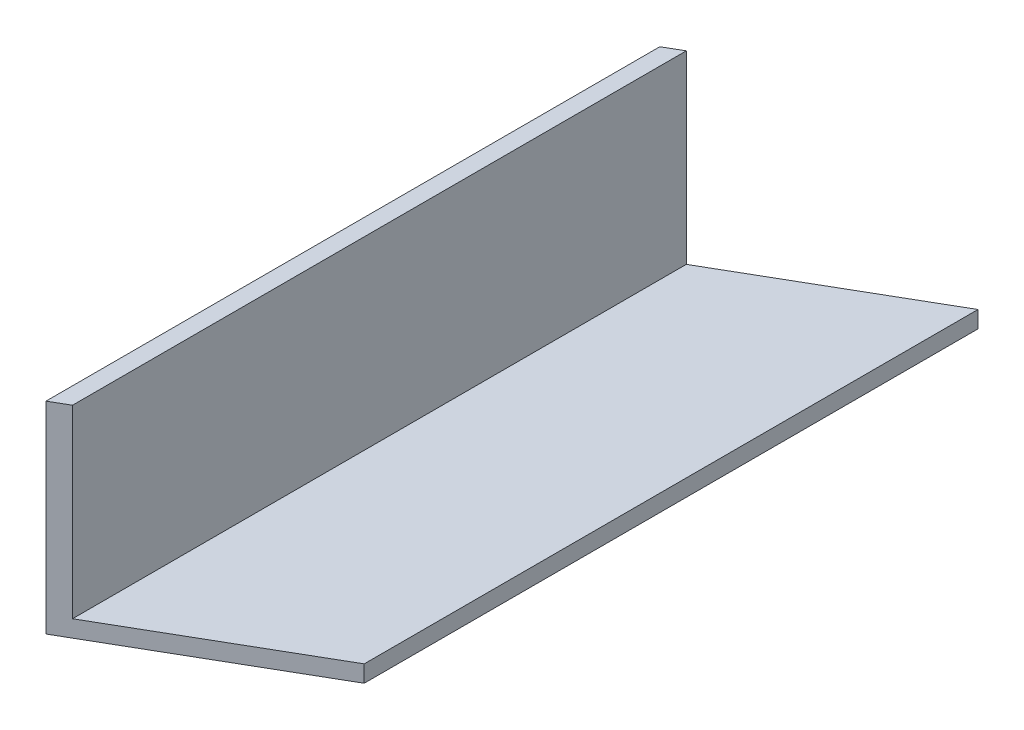
ISO-10303-21;
HEADER;
FILE_DESCRIPTION(('STEP AP214'),'2;1');
FILE_NAME('part.step','',(''),(''),'','','');
FILE_SCHEMA(('AUTOMOTIVE_DESIGN { 1 0 10303 214 1 1 1 1 }'));
ENDSEC;
DATA;
#1=APPLICATION_CONTEXT('core data for automotive mechanical design processes');
#2=APPLICATION_PROTOCOL_DEFINITION('international standard','automotive_design',2000,#1);
#3=PRODUCT_CONTEXT('',#1,'mechanical');
#4=PRODUCT('Part','Part','',(#3));
#5=PRODUCT_RELATED_PRODUCT_CATEGORY('part','',(#4));
#6=PRODUCT_DEFINITION_FORMATION('','',#4);
#7=PRODUCT_DEFINITION_CONTEXT('part definition',#1,'design');
#8=PRODUCT_DEFINITION('design','',#6,#7);
#9=PRODUCT_DEFINITION_SHAPE('','',#8);
#10=(LENGTH_UNIT() NAMED_UNIT(*) SI_UNIT(.MILLI.,.METRE.));
#11=(NAMED_UNIT(*) PLANE_ANGLE_UNIT() SI_UNIT($,.RADIAN.));
#12=(NAMED_UNIT(*) SI_UNIT($,.STERADIAN.) SOLID_ANGLE_UNIT());
#13=UNCERTAINTY_MEASURE_WITH_UNIT(LENGTH_MEASURE(1.E-05),#10,'distance_accuracy_value','');
#14=(GEOMETRIC_REPRESENTATION_CONTEXT(3) GLOBAL_UNCERTAINTY_ASSIGNED_CONTEXT((#13)) GLOBAL_UNIT_ASSIGNED_CONTEXT((#10,
#11,#12)) REPRESENTATION_CONTEXT('',''));
#15=CARTESIAN_POINT('',(0.,0.,0.));
#16=DIRECTION('',(0.,0.,1.));
#17=DIRECTION('',(1.,0.,0.));
#18=AXIS2_PLACEMENT_3D('',#15,#16,#17);
#19=CARTESIAN_POINT('',(0.,0.,137.922));
#20=DIRECTION('',(1.,0.,0.));
#21=DIRECTION('',(0.,0.,-1.));
#22=AXIS2_PLACEMENT_3D('',#19,#20,#21);
#23=PLANE('',#22);
#24=DIRECTION('',(0.,0.,-1.));
#25=VECTOR('',#24,1.);
#26=CARTESIAN_POINT('',(0.,38.1,137.922));
#27=LINE('',#26,#25);
#28=CARTESIAN_POINT('',(0.,38.1,137.922));
#29=VERTEX_POINT('',#28);
#30=CARTESIAN_POINT('',(0.,38.1,21.997045256125));
#31=VERTEX_POINT('',#30);
#32=EDGE_CURVE('E94',#29,#31,#27,.T.);
#33=ORIENTED_EDGE('',*,*,#32,.T.);
#34=DIRECTION('',(0.,-1.,0.));
#35=VECTOR('',#34,1.);
#36=CARTESIAN_POINT('',(0.,38.1,21.997045256125));
#37=LINE('',#36,#35);
#38=CARTESIAN_POINT('',(0.,0.,21.997045256125));
#39=VERTEX_POINT('',#38);
#40=EDGE_CURVE('E139',#31,#39,#37,.T.);
#41=ORIENTED_EDGE('',*,*,#40,.T.);
#42=DIRECTION('',(0.,0.,-1.));
#43=VECTOR('',#42,1.);
#44=CARTESIAN_POINT('',(0.,0.,137.922));
#45=LINE('',#44,#43);
#46=CARTESIAN_POINT('',(0.,0.,137.922));
#47=VERTEX_POINT('',#46);
#48=EDGE_CURVE('E102',#47,#39,#45,.T.);
#49=ORIENTED_EDGE('',*,*,#48,.F.);
#50=DIRECTION('',(0.,-1.,0.));
#51=VECTOR('',#50,1.);
#52=CARTESIAN_POINT('',(0.,0.,137.922));
#53=LINE('',#52,#51);
#54=EDGE_CURVE('E85',#29,#47,#53,.T.);
#55=ORIENTED_EDGE('',*,*,#54,.F.);
#56=EDGE_LOOP('',(#33,#41,#49,#55));
#57=FACE_BOUND('',#56,.T.);
#58=ADVANCED_FACE('F32',(#57),#23,.F.);
#59=CARTESIAN_POINT('',(0.,0.,137.922));
#60=DIRECTION('',(0.,1.,0.));
#61=DIRECTION('',(0.,0.,1.));
#62=AXIS2_PLACEMENT_3D('',#59,#60,#61);
#63=PLANE('',#62);
#64=DIRECTION('',(0.,0.,-1.));
#65=VECTOR('',#64,1.);
#66=CARTESIAN_POINT('',(38.1,0.,137.922));
#67=LINE('',#66,#65);
#68=CARTESIAN_POINT('',(38.1,0.,115.924954743875));
#69=VERTEX_POINT('',#68);
#70=CARTESIAN_POINT('',(38.1,0.,0.));
#71=VERTEX_POINT('',#70);
#72=EDGE_CURVE('E98',#69,#71,#67,.T.);
#73=ORIENTED_EDGE('',*,*,#72,.F.);
#74=DIRECTION('',(0.866025403784436,0.,-0.500000000000004));
#75=VECTOR('',#74,1.);
#76=CARTESIAN_POINT('',(38.1,0.,115.924954743875));
#77=LINE('',#76,#75);
#78=EDGE_CURVE('E91',#47,#69,#77,.T.);
#79=ORIENTED_EDGE('',*,*,#78,.F.);
#80=ORIENTED_EDGE('',*,*,#48,.T.);
#81=DIRECTION('',(-0.866025403784436,0.,0.500000000000004));
#82=VECTOR('',#81,1.);
#83=CARTESIAN_POINT('',(0.,0.,21.997045256125));
#84=LINE('',#83,#82);
#85=EDGE_CURVE('E135',#71,#39,#84,.T.);
#86=ORIENTED_EDGE('',*,*,#85,.F.);
#87=EDGE_LOOP('',(#73,#79,#80,#86));
#88=FACE_BOUND('',#87,.T.);
#89=ADVANCED_FACE('F137',(#88),#63,.F.);
#90=CARTESIAN_POINT('',(38.1,0.,137.922));
#91=DIRECTION('',(-1.,0.,0.));
#92=DIRECTION('',(0.,0.,1.));
#93=AXIS2_PLACEMENT_3D('',#90,#91,#92);
#94=PLANE('',#93);
#95=DIRECTION('',(0.,0.,1.));
#96=VECTOR('',#95,1.);
#97=CARTESIAN_POINT('',(38.1,3.175,0.));
#98=LINE('',#97,#96);
#99=CARTESIAN_POINT('',(38.1,3.17500000000001,0.));
#100=VERTEX_POINT('',#99);
#101=CARTESIAN_POINT('',(38.1,3.17500000000001,115.924954743875));
#102=VERTEX_POINT('',#101);
#103=EDGE_CURVE('E106',#100,#102,#98,.T.);
#104=ORIENTED_EDGE('',*,*,#103,.T.);
#105=DIRECTION('',(0.,-1.,0.));
#106=VECTOR('',#105,1.);
#107=CARTESIAN_POINT('',(38.1,38.1,115.924954743875));
#108=LINE('',#107,#106);
#109=EDGE_CURVE('E90',#102,#69,#108,.T.);
#110=ORIENTED_EDGE('',*,*,#109,.T.);
#111=ORIENTED_EDGE('',*,*,#72,.T.);
#112=DIRECTION('',(0.,1.,0.));
#113=VECTOR('',#112,1.);
#114=CARTESIAN_POINT('',(38.1,0.,0.));
#115=LINE('',#114,#113);
#116=EDGE_CURVE('E103',#71,#100,#115,.T.);
#117=ORIENTED_EDGE('',*,*,#116,.T.);
#118=EDGE_LOOP('',(#104,#110,#111,#117));
#119=FACE_BOUND('',#118,.T.);
#120=ADVANCED_FACE('F130',(#119),#94,.F.);
#121=CARTESIAN_POINT('',(0.,38.1,137.922));
#122=DIRECTION('',(0.,-1.,0.));
#123=DIRECTION('',(0.,0.,-1.));
#124=AXIS2_PLACEMENT_3D('',#121,#122,#123);
#125=PLANE('',#124);
#126=ORIENTED_EDGE('',*,*,#32,.F.);
#127=DIRECTION('',(0.866025403784436,0.,-0.500000000000004));
#128=VECTOR('',#127,1.);
#129=CARTESIAN_POINT('',(38.1,38.1,115.924954743875));
#130=LINE('',#129,#128);
#131=CARTESIAN_POINT('',(3.17499999999999,38.1,136.088912895323));
#132=VERTEX_POINT('',#131);
#133=EDGE_CURVE('E81',#29,#132,#130,.T.);
#134=ORIENTED_EDGE('',*,*,#133,.T.);
#135=DIRECTION('',(0.,0.,1.));
#136=VECTOR('',#135,1.);
#137=CARTESIAN_POINT('',(3.175,38.1,0.));
#138=LINE('',#137,#136);
#139=CARTESIAN_POINT('',(3.175,38.1,20.1639581514479));
#140=VERTEX_POINT('',#139);
#141=EDGE_CURVE('E109',#140,#132,#138,.T.);
#142=ORIENTED_EDGE('',*,*,#141,.F.);
#143=DIRECTION('',(-0.866025403784436,0.,0.500000000000004));
#144=VECTOR('',#143,1.);
#145=CARTESIAN_POINT('',(0.,38.1,21.997045256125));
#146=LINE('',#145,#144);
#147=EDGE_CURVE('E46',#140,#31,#146,.T.);
#148=ORIENTED_EDGE('',*,*,#147,.T.);
#149=EDGE_LOOP('',(#126,#134,#142,#148));
#150=FACE_BOUND('',#149,.T.);
#151=ADVANCED_FACE('F95',(#150),#125,.F.);
#152=CARTESIAN_POINT('',(38.1,3.175,0.));
#153=DIRECTION('',(0.,-1.,0.));
#154=DIRECTION('',(1.,0.,0.));
#155=AXIS2_PLACEMENT_3D('',#152,#153,#154);
#156=PLANE('',#155);
#157=DIRECTION('',(0.,0.,1.));
#158=VECTOR('',#157,1.);
#159=CARTESIAN_POINT('',(3.175,3.17499999999999,0.));
#160=LINE('',#159,#158);
#161=CARTESIAN_POINT('',(3.175,3.175,20.1639581514479));
#162=VERTEX_POINT('',#161);
#163=CARTESIAN_POINT('',(3.175,3.17499999999999,136.088912895323));
#164=VERTEX_POINT('',#163);
#165=EDGE_CURVE('E118',#162,#164,#160,.T.);
#166=ORIENTED_EDGE('',*,*,#165,.T.);
#167=DIRECTION('',(0.866025403784436,0.,-0.500000000000004));
#168=VECTOR('',#167,1.);
#169=CARTESIAN_POINT('',(88.2969778703788,3.175,86.9437160579058));
#170=LINE('',#169,#168);
#171=EDGE_CURVE('E54',#164,#102,#170,.T.);
#172=ORIENTED_EDGE('',*,*,#171,.T.);
#173=ORIENTED_EDGE('',*,*,#103,.F.);
#174=DIRECTION('',(-0.866025403784436,0.,0.500000000000004));
#175=VECTOR('',#174,1.);
#176=CARTESIAN_POINT('',(38.1,3.175,0.));
#177=LINE('',#176,#175);
#178=EDGE_CURVE('E120',#100,#162,#177,.T.);
#179=ORIENTED_EDGE('',*,*,#178,.T.);
#180=EDGE_LOOP('',(#166,#172,#173,#179));
#181=FACE_BOUND('',#180,.T.);
#182=ADVANCED_FACE('F132',(#181),#156,.F.);
#183=CARTESIAN_POINT('',(3.175,38.1,0.));
#184=DIRECTION('',(-1.,0.,0.));
#185=DIRECTION('',(0.,-1.,0.));
#186=AXIS2_PLACEMENT_3D('',#183,#184,#185);
#187=PLANE('',#186);
#188=ORIENTED_EDGE('',*,*,#141,.T.);
#189=DIRECTION('',(0.,-1.,0.));
#190=VECTOR('',#189,1.);
#191=CARTESIAN_POINT('',(3.175,38.1,136.088912895323));
#192=LINE('',#191,#190);
#193=EDGE_CURVE('E11',#132,#164,#192,.T.);
#194=ORIENTED_EDGE('',*,*,#193,.T.);
#195=ORIENTED_EDGE('',*,*,#165,.F.);
#196=DIRECTION('',(0.,1.,0.));
#197=VECTOR('',#196,1.);
#198=CARTESIAN_POINT('',(3.175,38.1,20.1639581514479));
#199=LINE('',#198,#197);
#200=EDGE_CURVE('E39',#162,#140,#199,.T.);
#201=ORIENTED_EDGE('',*,*,#200,.T.);
#202=EDGE_LOOP('',(#188,#194,#195,#201));
#203=FACE_BOUND('',#202,.T.);
#204=ADVANCED_FACE('F116',(#203),#187,.F.);
#205=CARTESIAN_POINT('',(0.,38.1,21.997045256125));
#206=DIRECTION('',(0.500000000000004,0.,0.866025403784436));
#207=DIRECTION('',(0.866025403784436,0.,-0.500000000000004));
#208=AXIS2_PLACEMENT_3D('',#205,#206,#207);
#209=PLANE('',#208);
#210=ORIENTED_EDGE('',*,*,#116,.F.);
#211=ORIENTED_EDGE('',*,*,#85,.T.);
#212=ORIENTED_EDGE('',*,*,#40,.F.);
#213=ORIENTED_EDGE('',*,*,#147,.F.);
#214=ORIENTED_EDGE('',*,*,#200,.F.);
#215=ORIENTED_EDGE('',*,*,#178,.F.);
#216=EDGE_LOOP('',(#210,#211,#212,#213,#214,#215));
#217=FACE_BOUND('',#216,.T.);
#218=ADVANCED_FACE('F133',(#217),#209,.F.);
#219=CARTESIAN_POINT('',(38.1,38.1,115.924954743875));
#220=DIRECTION('',(-0.500000000000004,0.,-0.866025403784436));
#221=DIRECTION('',(-0.866025403784436,0.,0.500000000000004));
#222=AXIS2_PLACEMENT_3D('',#219,#220,#221);
#223=PLANE('',#222);
#224=ORIENTED_EDGE('',*,*,#193,.F.);
#225=ORIENTED_EDGE('',*,*,#133,.F.);
#226=ORIENTED_EDGE('',*,*,#54,.T.);
#227=ORIENTED_EDGE('',*,*,#78,.T.);
#228=ORIENTED_EDGE('',*,*,#109,.F.);
#229=ORIENTED_EDGE('',*,*,#171,.F.);
#230=EDGE_LOOP('',(#224,#225,#226,#227,#228,#229));
#231=FACE_BOUND('',#230,.T.);
#232=ADVANCED_FACE('F83',(#231),#223,.F.);
#233=CLOSED_SHELL('',(#58,#89,#120,#151,#182,#204,#218,#232));
#234=MANIFOLD_SOLID_BREP('B2',#233);
#235=ADVANCED_BREP_SHAPE_REPRESENTATION('',(#18,#234),#14);
#236=SHAPE_DEFINITION_REPRESENTATION(#9,#235);
ENDSEC;
END-ISO-10303-21;
